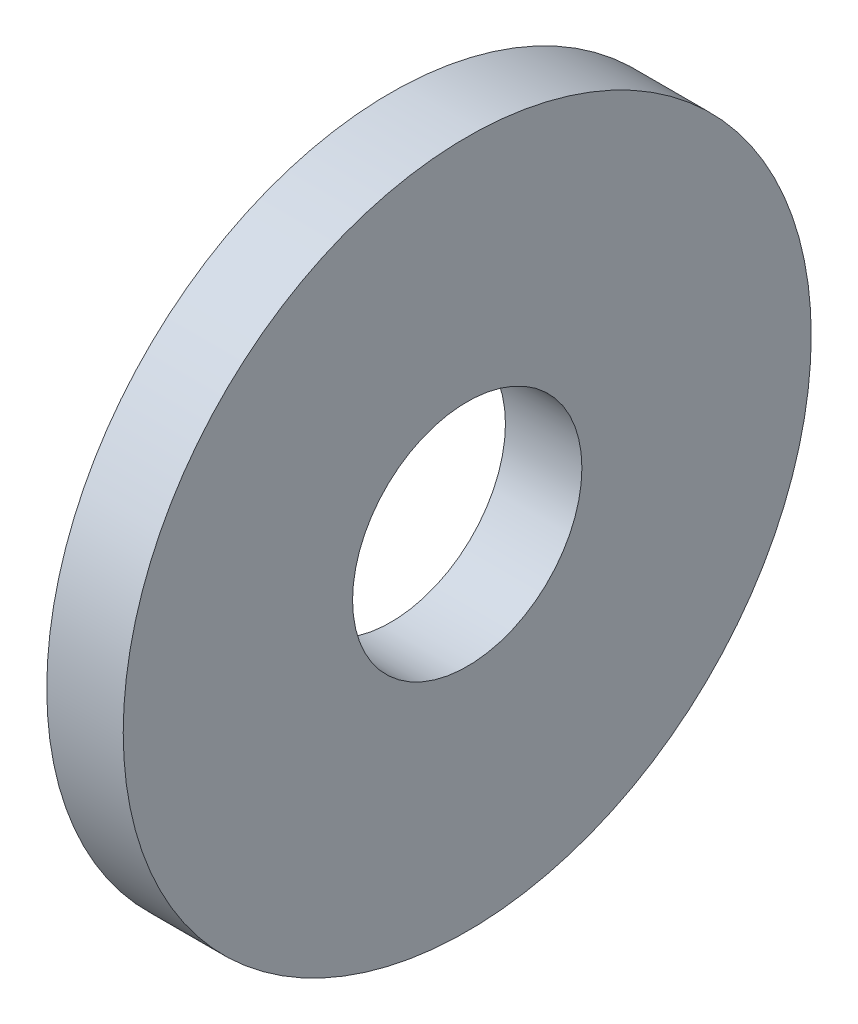
ISO-10303-21;
HEADER;
FILE_DESCRIPTION(('STEP AP214'),'2;1');
FILE_NAME('part.step','',(''),(''),'','','');
FILE_SCHEMA(('AUTOMOTIVE_DESIGN { 1 0 10303 214 1 1 1 1 }'));
ENDSEC;
DATA;
#1=APPLICATION_CONTEXT('core data for automotive mechanical design processes');
#2=APPLICATION_PROTOCOL_DEFINITION('international standard','automotive_design',2000,#1);
#3=PRODUCT_CONTEXT('',#1,'mechanical');
#4=PRODUCT('Part','Part','',(#3));
#5=PRODUCT_RELATED_PRODUCT_CATEGORY('part','',(#4));
#6=PRODUCT_DEFINITION_FORMATION('','',#4);
#7=PRODUCT_DEFINITION_CONTEXT('part definition',#1,'design');
#8=PRODUCT_DEFINITION('design','',#6,#7);
#9=PRODUCT_DEFINITION_SHAPE('','',#8);
#10=(LENGTH_UNIT() NAMED_UNIT(*) SI_UNIT(.MILLI.,.METRE.));
#11=(NAMED_UNIT(*) PLANE_ANGLE_UNIT() SI_UNIT($,.RADIAN.));
#12=(NAMED_UNIT(*) SI_UNIT($,.STERADIAN.) SOLID_ANGLE_UNIT());
#13=UNCERTAINTY_MEASURE_WITH_UNIT(LENGTH_MEASURE(1.E-05),#10,'distance_accuracy_value','');
#14=(GEOMETRIC_REPRESENTATION_CONTEXT(3) GLOBAL_UNCERTAINTY_ASSIGNED_CONTEXT((#13)) GLOBAL_UNIT_ASSIGNED_CONTEXT((#10,
#11,#12)) REPRESENTATION_CONTEXT('',''));
#15=CARTESIAN_POINT('',(0.,0.,0.));
#16=DIRECTION('',(0.,0.,1.));
#17=DIRECTION('',(1.,0.,0.));
#18=AXIS2_PLACEMENT_3D('',#15,#16,#17);
#19=CARTESIAN_POINT('',(2.,0.,0.));
#20=DIRECTION('',(-1.,0.,0.));
#21=DIRECTION('',(0.,0.,1.));
#22=AXIS2_PLACEMENT_3D('',#19,#20,#21);
#23=CYLINDRICAL_SURFACE('',#22,9.);
#24=CARTESIAN_POINT('',(2.,0.,0.));
#25=DIRECTION('',(1.,0.,0.));
#26=DIRECTION('',(0.,0.,-1.));
#27=AXIS2_PLACEMENT_3D('',#24,#25,#26);
#28=CIRCLE('',#27,9.);
#29=CARTESIAN_POINT('',(2.,0.,-9.));
#30=VERTEX_POINT('',#29);
#31=EDGE_CURVE('E10',#30,#30,#28,.T.);
#32=ORIENTED_EDGE('',*,*,#31,.F.);
#33=EDGE_LOOP('',(#32));
#34=FACE_BOUND('',#33,.T.);
#35=CARTESIAN_POINT('',(0.,0.,0.));
#36=DIRECTION('',(1.,0.,0.));
#37=DIRECTION('',(0.,0.,-1.));
#38=AXIS2_PLACEMENT_3D('',#35,#36,#37);
#39=CIRCLE('',#38,9.);
#40=CARTESIAN_POINT('',(0.,0.,-9.));
#41=VERTEX_POINT('',#40);
#42=EDGE_CURVE('E34',#41,#41,#39,.T.);
#43=ORIENTED_EDGE('',*,*,#42,.T.);
#44=EDGE_LOOP('',(#43));
#45=FACE_BOUND('',#44,.T.);
#46=ADVANCED_FACE('F31',(#34,#45),#23,.T.);
#47=CARTESIAN_POINT('',(2.,0.,0.));
#48=DIRECTION('',(1.,0.,0.));
#49=DIRECTION('',(0.,0.,-1.));
#50=AXIS2_PLACEMENT_3D('',#47,#48,#49);
#51=PLANE('',#50);
#52=CARTESIAN_POINT('',(2.,0.,0.));
#53=DIRECTION('',(1.,0.,0.));
#54=DIRECTION('',(0.,0.,-1.));
#55=AXIS2_PLACEMENT_3D('',#52,#53,#54);
#56=CIRCLE('',#55,3.);
#57=CARTESIAN_POINT('',(2.,0.,-3.));
#58=VERTEX_POINT('',#57);
#59=EDGE_CURVE('E43',#58,#58,#56,.T.);
#60=ORIENTED_EDGE('',*,*,#59,.F.);
#61=EDGE_LOOP('',(#60));
#62=FACE_BOUND('',#61,.T.);
#63=ORIENTED_EDGE('',*,*,#31,.T.);
#64=EDGE_LOOP('',(#63));
#65=FACE_BOUND('',#64,.T.);
#66=ADVANCED_FACE('F58',(#62,#65),#51,.T.);
#67=CARTESIAN_POINT('',(0.,0.,0.));
#68=DIRECTION('',(1.,0.,0.));
#69=DIRECTION('',(0.,0.,-1.));
#70=AXIS2_PLACEMENT_3D('',#67,#68,#69);
#71=PLANE('',#70);
#72=CARTESIAN_POINT('',(0.,0.,0.));
#73=DIRECTION('',(1.,0.,0.));
#74=DIRECTION('',(0.,0.,-1.));
#75=AXIS2_PLACEMENT_3D('',#72,#73,#74);
#76=CIRCLE('',#75,3.);
#77=CARTESIAN_POINT('',(0.,0.,-3.));
#78=VERTEX_POINT('',#77);
#79=EDGE_CURVE('E41',#78,#78,#76,.T.);
#80=ORIENTED_EDGE('',*,*,#79,.T.);
#81=EDGE_LOOP('',(#80));
#82=FACE_BOUND('',#81,.T.);
#83=ORIENTED_EDGE('',*,*,#42,.F.);
#84=EDGE_LOOP('',(#83));
#85=FACE_BOUND('',#84,.T.);
#86=ADVANCED_FACE('F49',(#82,#85),#71,.F.);
#87=CARTESIAN_POINT('',(0.,0.,0.));
#88=DIRECTION('',(1.,0.,0.));
#89=DIRECTION('',(0.,0.,-1.));
#90=AXIS2_PLACEMENT_3D('',#87,#88,#89);
#91=CYLINDRICAL_SURFACE('',#90,3.);
#92=ORIENTED_EDGE('',*,*,#79,.F.);
#93=EDGE_LOOP('',(#92));
#94=FACE_BOUND('',#93,.T.);
#95=ORIENTED_EDGE('',*,*,#59,.T.);
#96=EDGE_LOOP('',(#95));
#97=FACE_BOUND('',#96,.T.);
#98=ADVANCED_FACE('F52',(#94,#97),#91,.F.);
#99=CLOSED_SHELL('',(#46,#66,#86,#98));
#100=MANIFOLD_SOLID_BREP('B2',#99);
#101=ADVANCED_BREP_SHAPE_REPRESENTATION('',(#18,#100),#14);
#102=SHAPE_DEFINITION_REPRESENTATION(#9,#101);
ENDSEC;
END-ISO-10303-21;
